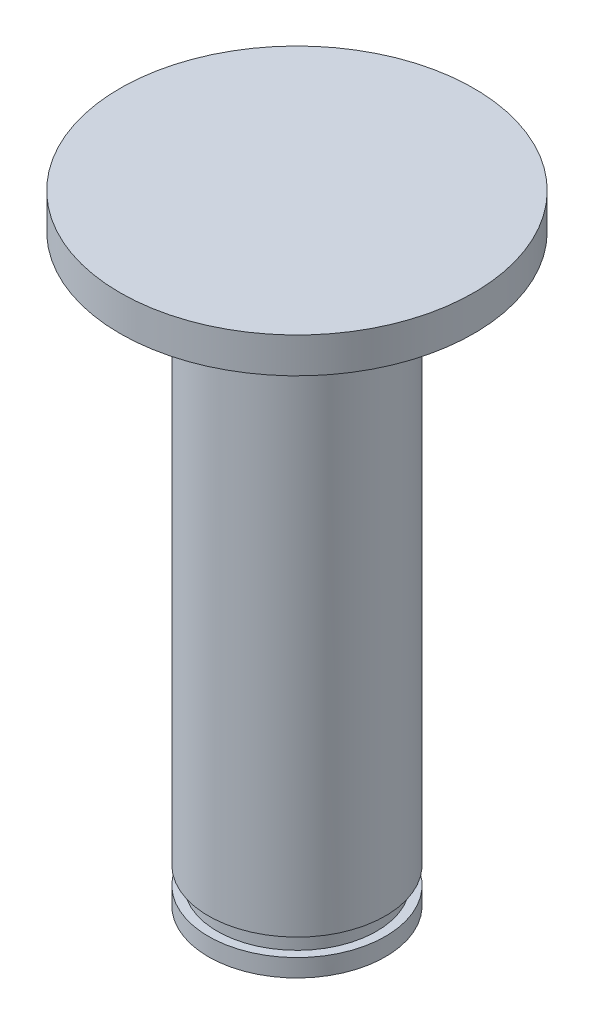
ISO-10303-21;
HEADER;
FILE_DESCRIPTION(('STEP AP214'),'2;1');
FILE_NAME('part.step','',(''),(''),'','','');
FILE_SCHEMA(('AUTOMOTIVE_DESIGN { 1 0 10303 214 1 1 1 1 }'));
ENDSEC;
DATA;
#1=APPLICATION_CONTEXT('core data for automotive mechanical design processes');
#2=APPLICATION_PROTOCOL_DEFINITION('international standard','automotive_design',2000,#1);
#3=PRODUCT_CONTEXT('',#1,'mechanical');
#4=PRODUCT('Part','Part','',(#3));
#5=PRODUCT_RELATED_PRODUCT_CATEGORY('part','',(#4));
#6=PRODUCT_DEFINITION_FORMATION('','',#4);
#7=PRODUCT_DEFINITION_CONTEXT('part definition',#1,'design');
#8=PRODUCT_DEFINITION('design','',#6,#7);
#9=PRODUCT_DEFINITION_SHAPE('','',#8);
#10=(LENGTH_UNIT() NAMED_UNIT(*) SI_UNIT(.MILLI.,.METRE.));
#11=(NAMED_UNIT(*) PLANE_ANGLE_UNIT() SI_UNIT($,.RADIAN.));
#12=(NAMED_UNIT(*) SI_UNIT($,.STERADIAN.) SOLID_ANGLE_UNIT());
#13=UNCERTAINTY_MEASURE_WITH_UNIT(LENGTH_MEASURE(1.E-05),#10,'distance_accuracy_value','');
#14=(GEOMETRIC_REPRESENTATION_CONTEXT(3) GLOBAL_UNCERTAINTY_ASSIGNED_CONTEXT((#13)) GLOBAL_UNIT_ASSIGNED_CONTEXT((#10,
#11,#12)) REPRESENTATION_CONTEXT('',''));
#15=CARTESIAN_POINT('',(0.,0.,0.));
#16=DIRECTION('',(0.,0.,1.));
#17=DIRECTION('',(1.,0.,0.));
#18=AXIS2_PLACEMENT_3D('',#15,#16,#17);
#19=CARTESIAN_POINT('',(0.,33.,0.));
#20=DIRECTION('',(0.,-1.,0.));
#21=DIRECTION('',(0.,0.,-1.));
#22=AXIS2_PLACEMENT_3D('',#19,#20,#21);
#23=CYLINDRICAL_SURFACE('',#22,5.);
#24=CARTESIAN_POINT('',(0.,33.,0.));
#25=DIRECTION('',(0.,1.,0.));
#26=DIRECTION('',(0.,0.,1.));
#27=AXIS2_PLACEMENT_3D('',#24,#25,#26);
#28=CIRCLE('',#27,5.);
#29=CARTESIAN_POINT('',(0.,33.,5.));
#30=VERTEX_POINT('',#29);
#31=EDGE_CURVE('E10',#30,#30,#28,.T.);
#32=ORIENTED_EDGE('',*,*,#31,.F.);
#33=EDGE_LOOP('',(#32));
#34=FACE_BOUND('',#33,.T.);
#35=CARTESIAN_POINT('',(0.,2.,0.));
#36=DIRECTION('',(0.,-1.,0.));
#37=DIRECTION('',(0.,0.,-1.));
#38=AXIS2_PLACEMENT_3D('',#35,#36,#37);
#39=CIRCLE('',#38,5.);
#40=CARTESIAN_POINT('',(0.,2.,-5.));
#41=VERTEX_POINT('',#40);
#42=EDGE_CURVE('E49',#41,#41,#39,.T.);
#43=ORIENTED_EDGE('',*,*,#42,.F.);
#44=EDGE_LOOP('',(#43));
#45=FACE_BOUND('',#44,.T.);
#46=ADVANCED_FACE('F30',(#34,#45),#23,.T.);
#47=CARTESIAN_POINT('',(0.,35.,0.));
#48=DIRECTION('',(0.,-1.,0.));
#49=DIRECTION('',(0.,0.,-1.));
#50=AXIS2_PLACEMENT_3D('',#47,#48,#49);
#51=CYLINDRICAL_SURFACE('',#50,10.);
#52=CARTESIAN_POINT('',(0.,35.,0.));
#53=DIRECTION('',(0.,1.,0.));
#54=DIRECTION('',(0.,0.,1.));
#55=AXIS2_PLACEMENT_3D('',#52,#53,#54);
#56=CIRCLE('',#55,10.);
#57=CARTESIAN_POINT('',(0.,35.,10.));
#58=VERTEX_POINT('',#57);
#59=EDGE_CURVE('E41',#58,#58,#56,.T.);
#60=ORIENTED_EDGE('',*,*,#59,.F.);
#61=EDGE_LOOP('',(#60));
#62=FACE_BOUND('',#61,.T.);
#63=CARTESIAN_POINT('',(0.,33.,0.));
#64=DIRECTION('',(0.,1.,0.));
#65=DIRECTION('',(0.,0.,1.));
#66=AXIS2_PLACEMENT_3D('',#63,#64,#65);
#67=CIRCLE('',#66,10.);
#68=CARTESIAN_POINT('',(0.,33.,10.));
#69=VERTEX_POINT('',#68);
#70=EDGE_CURVE('E43',#69,#69,#67,.T.);
#71=ORIENTED_EDGE('',*,*,#70,.T.);
#72=EDGE_LOOP('',(#71));
#73=FACE_BOUND('',#72,.T.);
#74=ADVANCED_FACE('F82',(#62,#73),#51,.T.);
#75=CARTESIAN_POINT('',(0.,35.,0.));
#76=DIRECTION('',(0.,1.,0.));
#77=DIRECTION('',(0.,0.,1.));
#78=AXIS2_PLACEMENT_3D('',#75,#76,#77);
#79=PLANE('',#78);
#80=ORIENTED_EDGE('',*,*,#59,.T.);
#81=EDGE_LOOP('',(#80));
#82=FACE_BOUND('',#81,.T.);
#83=ADVANCED_FACE('F87',(#82),#79,.T.);
#84=CARTESIAN_POINT('',(0.,33.,0.));
#85=DIRECTION('',(0.,1.,0.));
#86=DIRECTION('',(0.,0.,1.));
#87=AXIS2_PLACEMENT_3D('',#84,#85,#86);
#88=PLANE('',#87);
#89=ORIENTED_EDGE('',*,*,#31,.T.);
#90=EDGE_LOOP('',(#89));
#91=FACE_BOUND('',#90,.T.);
#92=ORIENTED_EDGE('',*,*,#70,.F.);
#93=EDGE_LOOP('',(#92));
#94=FACE_BOUND('',#93,.T.);
#95=ADVANCED_FACE('F77',(#91,#94),#88,.F.);
#96=CARTESIAN_POINT('',(0.,1.,0.));
#97=DIRECTION('',(0.,-1.,0.));
#98=DIRECTION('',(0.,0.,-1.));
#99=AXIS2_PLACEMENT_3D('',#96,#97,#98);
#100=PLANE('',#99);
#101=CARTESIAN_POINT('',(0.,1.,0.));
#102=DIRECTION('',(0.,-1.,0.));
#103=DIRECTION('',(0.,0.,-1.));
#104=AXIS2_PLACEMENT_3D('',#101,#102,#103);
#105=CIRCLE('',#104,5.);
#106=CARTESIAN_POINT('',(0.,1.,-5.));
#107=VERTEX_POINT('',#106);
#108=EDGE_CURVE('E46',#107,#107,#105,.T.);
#109=ORIENTED_EDGE('',*,*,#108,.F.);
#110=EDGE_LOOP('',(#109));
#111=FACE_BOUND('',#110,.T.);
#112=CARTESIAN_POINT('',(0.,1.,0.));
#113=DIRECTION('',(0.,-1.,0.));
#114=DIRECTION('',(0.,0.,-1.));
#115=AXIS2_PLACEMENT_3D('',#112,#113,#114);
#116=CIRCLE('',#115,4.5);
#117=CARTESIAN_POINT('',(0.,1.,-4.5));
#118=VERTEX_POINT('',#117);
#119=EDGE_CURVE('E52',#118,#118,#116,.T.);
#120=ORIENTED_EDGE('',*,*,#119,.T.);
#121=EDGE_LOOP('',(#120));
#122=FACE_BOUND('',#121,.T.);
#123=ADVANCED_FACE('F61',(#111,#122),#100,.F.);
#124=CARTESIAN_POINT('',(0.,2.,0.));
#125=DIRECTION('',(0.,-1.,0.));
#126=DIRECTION('',(0.,0.,-1.));
#127=AXIS2_PLACEMENT_3D('',#124,#125,#126);
#128=PLANE('',#127);
#129=ORIENTED_EDGE('',*,*,#42,.T.);
#130=EDGE_LOOP('',(#129));
#131=FACE_BOUND('',#130,.T.);
#132=CARTESIAN_POINT('',(0.,2.,0.));
#133=DIRECTION('',(0.,-1.,0.));
#134=DIRECTION('',(0.,0.,-1.));
#135=AXIS2_PLACEMENT_3D('',#132,#133,#134);
#136=CIRCLE('',#135,4.5);
#137=CARTESIAN_POINT('',(0.,2.,-4.5));
#138=VERTEX_POINT('',#137);
#139=EDGE_CURVE('E55',#138,#138,#136,.T.);
#140=ORIENTED_EDGE('',*,*,#139,.F.);
#141=EDGE_LOOP('',(#140));
#142=FACE_BOUND('',#141,.T.);
#143=ADVANCED_FACE('F67',(#131,#142),#128,.T.);
#144=CARTESIAN_POINT('',(0.,1.,0.));
#145=DIRECTION('',(0.,1.,0.));
#146=DIRECTION('',(0.,0.,1.));
#147=AXIS2_PLACEMENT_3D('',#144,#145,#146);
#148=CYLINDRICAL_SURFACE('',#147,4.5);
#149=ORIENTED_EDGE('',*,*,#119,.F.);
#150=EDGE_LOOP('',(#149));
#151=FACE_BOUND('',#150,.T.);
#152=ORIENTED_EDGE('',*,*,#139,.T.);
#153=EDGE_LOOP('',(#152));
#154=FACE_BOUND('',#153,.T.);
#155=ADVANCED_FACE('F63',(#151,#154),#148,.T.);
#156=CARTESIAN_POINT('',(0.,0.,0.));
#157=DIRECTION('',(0.,1.,0.));
#158=DIRECTION('',(0.,0.,1.));
#159=AXIS2_PLACEMENT_3D('',#156,#157,#158);
#160=PLANE('',#159);
#161=CARTESIAN_POINT('',(0.,0.,0.));
#162=DIRECTION('',(0.,1.,0.));
#163=DIRECTION('',(0.,0.,1.));
#164=AXIS2_PLACEMENT_3D('',#161,#162,#163);
#165=CIRCLE('',#164,5.);
#166=CARTESIAN_POINT('',(0.,0.,5.));
#167=VERTEX_POINT('',#166);
#168=EDGE_CURVE('E34',#167,#167,#165,.T.);
#169=ORIENTED_EDGE('',*,*,#168,.F.);
#170=EDGE_LOOP('',(#169));
#171=FACE_BOUND('',#170,.T.);
#172=ADVANCED_FACE('F66',(#171),#160,.F.);
#173=ORIENTED_EDGE('',*,*,#108,.T.);
#174=EDGE_LOOP('',(#173));
#175=FACE_BOUND('',#174,.T.);
#176=ORIENTED_EDGE('',*,*,#168,.T.);
#177=EDGE_LOOP('',(#176));
#178=FACE_BOUND('',#177,.T.);
#179=ADVANCED_FACE('F32',(#175,#178),#23,.T.);
#180=CLOSED_SHELL('',(#46,#74,#83,#95,#123,#143,#155,#172,#179));
#181=MANIFOLD_SOLID_BREP('B2',#180);
#182=ADVANCED_BREP_SHAPE_REPRESENTATION('',(#18,#181),#14);
#183=SHAPE_DEFINITION_REPRESENTATION(#9,#182);
ENDSEC;
END-ISO-10303-21;
